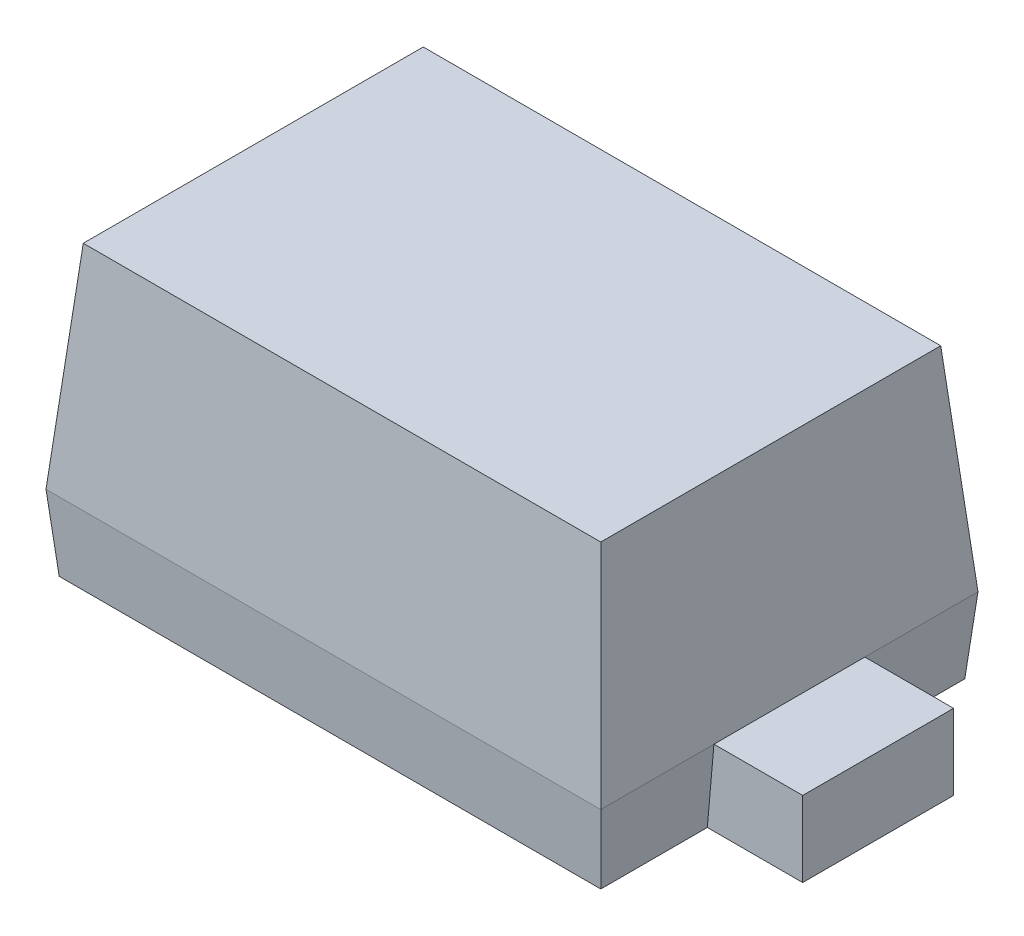
ISO-10303-21;
HEADER;
FILE_DESCRIPTION(('STEP AP214'),'2;1');
FILE_NAME('part.step','',(''),(''),'','','');
FILE_SCHEMA(('AUTOMOTIVE_DESIGN { 1 0 10303 214 1 1 1 1 }'));
ENDSEC;
DATA;
#1=APPLICATION_CONTEXT('core data for automotive mechanical design processes');
#2=APPLICATION_PROTOCOL_DEFINITION('international standard','automotive_design',2000,#1);
#3=PRODUCT_CONTEXT('',#1,'mechanical');
#4=PRODUCT('Part','Part','',(#3));
#5=PRODUCT_RELATED_PRODUCT_CATEGORY('part','',(#4));
#6=PRODUCT_DEFINITION_FORMATION('','',#4);
#7=PRODUCT_DEFINITION_CONTEXT('part definition',#1,'design');
#8=PRODUCT_DEFINITION('design','',#6,#7);
#9=PRODUCT_DEFINITION_SHAPE('','',#8);
#10=(LENGTH_UNIT() NAMED_UNIT(*) SI_UNIT(.MILLI.,.METRE.));
#11=(NAMED_UNIT(*) PLANE_ANGLE_UNIT() SI_UNIT($,.RADIAN.));
#12=(NAMED_UNIT(*) SI_UNIT($,.STERADIAN.) SOLID_ANGLE_UNIT());
#13=UNCERTAINTY_MEASURE_WITH_UNIT(LENGTH_MEASURE(1.E-05),#10,'distance_accuracy_value','');
#14=(GEOMETRIC_REPRESENTATION_CONTEXT(3) GLOBAL_UNCERTAINTY_ASSIGNED_CONTEXT((#13)) GLOBAL_UNIT_ASSIGNED_CONTEXT((#10,
#11,#12)) REPRESENTATION_CONTEXT('',''));
#15=CARTESIAN_POINT('',(0.,0.,0.));
#16=DIRECTION('',(0.,0.,1.));
#17=DIRECTION('',(1.,0.,0.));
#18=AXIS2_PLACEMENT_3D('',#15,#16,#17);
#19=CARTESIAN_POINT('',(-0.625,0.,0.425));
#20=DIRECTION('',(-0.996194698091746,-0.0871557427476584,0.));
#21=DIRECTION('',(0.0871557427476584,-0.996194698091746,0.));
#22=AXIS2_PLACEMENT_3D('',#19,#20,#21);
#23=PLANE('',#22);
#24=DIRECTION('',(0.0871557427476584,-0.996194698091746,0.));
#25=VECTOR('',#24,1.);
#26=CARTESIAN_POINT('',(-0.625,0.,-0.17));
#27=LINE('',#26,#25);
#28=CARTESIAN_POINT('',(-0.625,0.,-0.17));
#29=VERTEX_POINT('',#28);
#30=CARTESIAN_POINT('',(-0.610126927200593,-0.17,-0.17));
#31=VERTEX_POINT('',#30);
#32=EDGE_CURVE('E167',#29,#31,#27,.T.);
#33=ORIENTED_EDGE('',*,*,#32,.F.);
#34=DIRECTION('',(0.,0.,1.));
#35=VECTOR('',#34,1.);
#36=CARTESIAN_POINT('',(-0.625,0.,0.425));
#37=LINE('',#36,#35);
#38=CARTESIAN_POINT('',(-0.625,0.,-0.425));
#39=VERTEX_POINT('',#38);
#40=EDGE_CURVE('E224',#39,#29,#37,.T.);
#41=ORIENTED_EDGE('',*,*,#40,.F.);
#42=DIRECTION('',(-0.0868265938642478,0.992432509138967,-0.0868265938642478));
#43=VECTOR('',#42,1.);
#44=CARTESIAN_POINT('',(-0.625,0.,-0.425));
#45=LINE('',#44,#43);
#46=CARTESIAN_POINT('',(-0.610126927200593,-0.17,-0.410126927200593));
#47=VERTEX_POINT('',#46);
#48=EDGE_CURVE('E235',#47,#39,#45,.T.);
#49=ORIENTED_EDGE('',*,*,#48,.F.);
#50=DIRECTION('',(0.,0.,1.));
#51=VECTOR('',#50,1.);
#52=CARTESIAN_POINT('',(-0.610126927200593,-0.17,0.425));
#53=LINE('',#52,#51);
#54=EDGE_CURVE('E244',#47,#31,#53,.T.);
#55=ORIENTED_EDGE('',*,*,#54,.T.);
#56=EDGE_LOOP('',(#33,#41,#49,#55));
#57=FACE_BOUND('',#56,.T.);
#58=ADVANCED_FACE('F33',(#57),#23,.T.);
#59=CARTESIAN_POINT('',(0.625,0.,0.425));
#60=DIRECTION('',(0.996194698091746,-0.0871557427476584,0.));
#61=DIRECTION('',(0.0871557427476584,0.996194698091746,0.));
#62=AXIS2_PLACEMENT_3D('',#59,#60,#61);
#63=PLANE('',#62);
#64=DIRECTION('',(-0.0871557427476584,-0.996194698091746,0.));
#65=VECTOR('',#64,1.);
#66=CARTESIAN_POINT('',(0.625,0.,0.17));
#67=LINE('',#66,#65);
#68=CARTESIAN_POINT('',(0.625,0.,0.17));
#69=VERTEX_POINT('',#68);
#70=CARTESIAN_POINT('',(0.610126927200593,-0.17,0.17));
#71=VERTEX_POINT('',#70);
#72=EDGE_CURVE('E192',#69,#71,#67,.T.);
#73=ORIENTED_EDGE('',*,*,#72,.F.);
#74=DIRECTION('',(0.,0.,-1.));
#75=VECTOR('',#74,1.);
#76=CARTESIAN_POINT('',(0.625,0.,0.425));
#77=LINE('',#76,#75);
#78=CARTESIAN_POINT('',(0.625,0.,0.425));
#79=VERTEX_POINT('',#78);
#80=EDGE_CURVE('E216',#79,#69,#77,.T.);
#81=ORIENTED_EDGE('',*,*,#80,.F.);
#82=DIRECTION('',(0.0868265938642478,0.992432509138967,0.0868265938642478));
#83=VECTOR('',#82,1.);
#84=CARTESIAN_POINT('',(0.615576428247416,-0.107711918010857,0.415576428247416));
#85=LINE('',#84,#83);
#86=CARTESIAN_POINT('',(0.610126927200593,-0.17,0.410126927200593));
#87=VERTEX_POINT('',#86);
#88=EDGE_CURVE('E11',#87,#79,#85,.T.);
#89=ORIENTED_EDGE('',*,*,#88,.F.);
#90=DIRECTION('',(0.,0.,-1.));
#91=VECTOR('',#90,1.);
#92=CARTESIAN_POINT('',(0.610126927200593,-0.17,0.425));
#93=LINE('',#92,#91);
#94=EDGE_CURVE('E240',#87,#71,#93,.T.);
#95=ORIENTED_EDGE('',*,*,#94,.T.);
#96=EDGE_LOOP('',(#73,#81,#89,#95));
#97=FACE_BOUND('',#96,.T.);
#98=ADVANCED_FACE('F307',(#97),#63,.T.);
#99=DIRECTION('',(0.0871557427476584,0.996194698091746,0.));
#100=VECTOR('',#99,1.);
#101=CARTESIAN_POINT('',(0.625,0.,-0.17));
#102=LINE('',#101,#100);
#103=CARTESIAN_POINT('',(0.610126927200593,-0.17,-0.17));
#104=VERTEX_POINT('',#103);
#105=CARTESIAN_POINT('',(0.625,0.,-0.17));
#106=VERTEX_POINT('',#105);
#107=EDGE_CURVE('E188',#104,#106,#102,.T.);
#108=ORIENTED_EDGE('',*,*,#107,.F.);
#109=CARTESIAN_POINT('',(0.610126927200593,-0.17,-0.410126927200593));
#110=VERTEX_POINT('',#109);
#111=EDGE_CURVE('E230',#104,#110,#93,.T.);
#112=ORIENTED_EDGE('',*,*,#111,.T.);
#113=DIRECTION('',(0.0868265938642478,0.992432509138967,-0.0868265938642478));
#114=VECTOR('',#113,1.);
#115=CARTESIAN_POINT('',(0.618591971208243,-0.0732441042473826,-0.418591971208243));
#116=LINE('',#115,#114);
#117=CARTESIAN_POINT('',(0.625,0.,-0.425));
#118=VERTEX_POINT('',#117);
#119=EDGE_CURVE('E232',#110,#118,#116,.T.);
#120=ORIENTED_EDGE('',*,*,#119,.T.);
#121=EDGE_CURVE('E198',#106,#118,#77,.T.);
#122=ORIENTED_EDGE('',*,*,#121,.F.);
#123=EDGE_LOOP('',(#108,#112,#120,#122));
#124=FACE_BOUND('',#123,.T.);
#125=ADVANCED_FACE('F281',(#124),#63,.T.);
#126=CARTESIAN_POINT('',(-0.625,0.,0.425));
#127=DIRECTION('',(0.,-0.0871557427476584,0.996194698091746));
#128=DIRECTION('',(0.,-0.996194698091746,-0.0871557427476584));
#129=AXIS2_PLACEMENT_3D('',#126,#127,#128);
#130=PLANE('',#129);
#131=DIRECTION('',(1.,0.,0.));
#132=VECTOR('',#131,1.);
#133=CARTESIAN_POINT('',(-0.625,0.,0.425));
#134=LINE('',#133,#132);
#135=CARTESIAN_POINT('',(-0.625,0.,0.425));
#136=VERTEX_POINT('',#135);
#137=EDGE_CURVE('E227',#136,#79,#134,.T.);
#138=ORIENTED_EDGE('',*,*,#137,.F.);
#139=DIRECTION('',(-0.0868265938642478,0.992432509138967,0.0868265938642478));
#140=VECTOR('',#139,1.);
#141=CARTESIAN_POINT('',(-0.625,0.,0.425));
#142=LINE('',#141,#140);
#143=CARTESIAN_POINT('',(-0.610126927200593,-0.17,0.410126927200593));
#144=VERTEX_POINT('',#143);
#145=EDGE_CURVE('E42',#144,#136,#142,.T.);
#146=ORIENTED_EDGE('',*,*,#145,.F.);
#147=DIRECTION('',(1.,0.,0.));
#148=VECTOR('',#147,1.);
#149=CARTESIAN_POINT('',(-0.625,-0.17,0.410126927200593));
#150=LINE('',#149,#148);
#151=EDGE_CURVE('E236',#144,#87,#150,.T.);
#152=ORIENTED_EDGE('',*,*,#151,.T.);
#153=ORIENTED_EDGE('',*,*,#88,.T.);
#154=EDGE_LOOP('',(#138,#146,#152,#153));
#155=FACE_BOUND('',#154,.T.);
#156=ADVANCED_FACE('F35',(#155),#130,.T.);
#157=DIRECTION('',(-0.0871557427476584,0.996194698091746,0.));
#158=VECTOR('',#157,1.);
#159=CARTESIAN_POINT('',(-0.625,0.,0.17));
#160=LINE('',#159,#158);
#161=CARTESIAN_POINT('',(-0.610126927200593,-0.17,0.17));
#162=VERTEX_POINT('',#161);
#163=CARTESIAN_POINT('',(-0.625,0.,0.17));
#164=VERTEX_POINT('',#163);
#165=EDGE_CURVE('E140',#162,#164,#160,.T.);
#166=ORIENTED_EDGE('',*,*,#165,.F.);
#167=EDGE_CURVE('E246',#162,#144,#53,.T.);
#168=ORIENTED_EDGE('',*,*,#167,.T.);
#169=ORIENTED_EDGE('',*,*,#145,.T.);
#170=EDGE_CURVE('E223',#164,#136,#37,.T.);
#171=ORIENTED_EDGE('',*,*,#170,.F.);
#172=EDGE_LOOP('',(#166,#168,#169,#171));
#173=FACE_BOUND('',#172,.T.);
#174=ADVANCED_FACE('F308',(#173),#23,.T.);
#175=CARTESIAN_POINT('',(-0.625,0.,-0.425));
#176=DIRECTION('',(0.,-0.0871557427476584,-0.996194698091746));
#177=DIRECTION('',(0.,0.996194698091746,-0.0871557427476584));
#178=AXIS2_PLACEMENT_3D('',#175,#176,#177);
#179=PLANE('',#178);
#180=DIRECTION('',(-1.,0.,0.));
#181=VECTOR('',#180,1.);
#182=CARTESIAN_POINT('',(-0.625,0.,-0.425));
#183=LINE('',#182,#181);
#184=EDGE_CURVE('E219',#118,#39,#183,.T.);
#185=ORIENTED_EDGE('',*,*,#184,.F.);
#186=ORIENTED_EDGE('',*,*,#119,.F.);
#187=DIRECTION('',(-1.,0.,0.));
#188=VECTOR('',#187,1.);
#189=CARTESIAN_POINT('',(-0.625,-0.17,-0.410126927200593));
#190=LINE('',#189,#188);
#191=EDGE_CURVE('E37',#110,#47,#190,.T.);
#192=ORIENTED_EDGE('',*,*,#191,.T.);
#193=ORIENTED_EDGE('',*,*,#48,.T.);
#194=EDGE_LOOP('',(#185,#186,#192,#193));
#195=FACE_BOUND('',#194,.T.);
#196=ADVANCED_FACE('F258',(#195),#179,.T.);
#197=CARTESIAN_POINT('',(0.,-0.17,0.));
#198=DIRECTION('',(0.,-1.,0.));
#199=DIRECTION('',(0.,0.,-1.));
#200=AXIS2_PLACEMENT_3D('',#197,#198,#199);
#201=PLANE('',#200);
#202=ORIENTED_EDGE('',*,*,#167,.F.);
#203=DIRECTION('',(-1.,0.,0.));
#204=VECTOR('',#203,1.);
#205=CARTESIAN_POINT('',(-0.825,-0.17,0.17));
#206=LINE('',#205,#204);
#207=CARTESIAN_POINT('',(-0.825,-0.17,0.17));
#208=VERTEX_POINT('',#207);
#209=EDGE_CURVE('E160',#162,#208,#206,.T.);
#210=ORIENTED_EDGE('',*,*,#209,.T.);
#211=DIRECTION('',(0.,0.,-1.));
#212=VECTOR('',#211,1.);
#213=CARTESIAN_POINT('',(-0.825,-0.17,-0.17));
#214=LINE('',#213,#212);
#215=CARTESIAN_POINT('',(-0.825,-0.17,-0.17));
#216=VERTEX_POINT('',#215);
#217=EDGE_CURVE('E150',#208,#216,#214,.T.);
#218=ORIENTED_EDGE('',*,*,#217,.T.);
#219=DIRECTION('',(1.,0.,0.));
#220=VECTOR('',#219,1.);
#221=CARTESIAN_POINT('',(-0.625,-0.17,-0.17));
#222=LINE('',#221,#220);
#223=EDGE_CURVE('E143',#216,#31,#222,.T.);
#224=ORIENTED_EDGE('',*,*,#223,.T.);
#225=ORIENTED_EDGE('',*,*,#54,.F.);
#226=ORIENTED_EDGE('',*,*,#191,.F.);
#227=ORIENTED_EDGE('',*,*,#111,.F.);
#228=DIRECTION('',(1.,0.,0.));
#229=VECTOR('',#228,1.);
#230=CARTESIAN_POINT('',(0.625,-0.17,-0.17));
#231=LINE('',#230,#229);
#232=CARTESIAN_POINT('',(0.825,-0.17,-0.17));
#233=VERTEX_POINT('',#232);
#234=EDGE_CURVE('E169',#104,#233,#231,.T.);
#235=ORIENTED_EDGE('',*,*,#234,.T.);
#236=DIRECTION('',(0.,0.,1.));
#237=VECTOR('',#236,1.);
#238=CARTESIAN_POINT('',(0.825,-0.17,-0.17));
#239=LINE('',#238,#237);
#240=CARTESIAN_POINT('',(0.825,-0.17,0.17));
#241=VERTEX_POINT('',#240);
#242=EDGE_CURVE('E180',#233,#241,#239,.T.);
#243=ORIENTED_EDGE('',*,*,#242,.T.);
#244=DIRECTION('',(-1.,0.,0.));
#245=VECTOR('',#244,1.);
#246=CARTESIAN_POINT('',(0.583005441507556,-0.17,0.17));
#247=LINE('',#246,#245);
#248=EDGE_CURVE('E172',#241,#71,#247,.T.);
#249=ORIENTED_EDGE('',*,*,#248,.T.);
#250=ORIENTED_EDGE('',*,*,#94,.F.);
#251=ORIENTED_EDGE('',*,*,#151,.F.);
#252=EDGE_LOOP('',(#202,#210,#218,#224,#225,#226,#227,#235,#243,#249,#250,#251));
#253=FACE_BOUND('',#252,.T.);
#254=ADVANCED_FACE('F262',(#253),#201,.T.);
#255=CARTESIAN_POINT('',(0.625,0.,0.425));
#256=DIRECTION('',(0.996194698091746,0.0871557427476584,0.));
#257=DIRECTION('',(-0.0871557427476584,0.996194698091746,0.));
#258=AXIS2_PLACEMENT_3D('',#255,#256,#257);
#259=PLANE('',#258);
#260=ORIENTED_EDGE('',*,*,#80,.T.);
#261=EDGE_CURVE('E220',#69,#106,#77,.T.);
#262=ORIENTED_EDGE('',*,*,#261,.T.);
#263=ORIENTED_EDGE('',*,*,#121,.T.);
#264=DIRECTION('',(0.0868265938642478,-0.992432509138967,-0.0868265938642478));
#265=VECTOR('',#264,1.);
#266=CARTESIAN_POINT('',(0.615576428247416,0.107711918010857,-0.415576428247416));
#267=LINE('',#266,#265);
#268=CARTESIAN_POINT('',(0.583005441507556,0.48,-0.383005441507556));
#269=VERTEX_POINT('',#268);
#270=EDGE_CURVE('E195',#269,#118,#267,.T.);
#271=ORIENTED_EDGE('',*,*,#270,.F.);
#272=DIRECTION('',(0.,0.,1.));
#273=VECTOR('',#272,1.);
#274=CARTESIAN_POINT('',(0.583005441507557,0.48,0.));
#275=LINE('',#274,#273);
#276=CARTESIAN_POINT('',(0.583005441507556,0.48,0.383005441507556));
#277=VERTEX_POINT('',#276);
#278=EDGE_CURVE('E194',#277,#269,#275,.F.);
#279=ORIENTED_EDGE('',*,*,#278,.F.);
#280=DIRECTION('',(0.0868265938642478,-0.992432509138967,0.0868265938642478));
#281=VECTOR('',#280,1.);
#282=CARTESIAN_POINT('',(0.625,0.,0.425));
#283=LINE('',#282,#281);
#284=EDGE_CURVE('E200',#277,#79,#283,.T.);
#285=ORIENTED_EDGE('',*,*,#284,.T.);
#286=EDGE_LOOP('',(#260,#262,#263,#271,#279,#285));
#287=FACE_BOUND('',#286,.T.);
#288=ADVANCED_FACE('F276',(#287),#259,.T.);
#289=CARTESIAN_POINT('',(-0.625,0.,-0.425));
#290=DIRECTION('',(0.,0.0871557427476584,-0.996194698091746));
#291=DIRECTION('',(0.,0.996194698091746,0.0871557427476584));
#292=AXIS2_PLACEMENT_3D('',#289,#290,#291);
#293=PLANE('',#292);
#294=ORIENTED_EDGE('',*,*,#184,.T.);
#295=DIRECTION('',(-0.0868265938642478,-0.992432509138967,-0.0868265938642478));
#296=VECTOR('',#295,1.);
#297=CARTESIAN_POINT('',(-0.618591971208243,0.0732441042473826,-0.418591971208243));
#298=LINE('',#297,#296);
#299=CARTESIAN_POINT('',(-0.583005441507556,0.48,-0.383005441507556));
#300=VERTEX_POINT('',#299);
#301=EDGE_CURVE('E199',#300,#39,#298,.T.);
#302=ORIENTED_EDGE('',*,*,#301,.F.);
#303=DIRECTION('',(1.,0.,0.));
#304=VECTOR('',#303,1.);
#305=CARTESIAN_POINT('',(0.,0.48,-0.383005441507556));
#306=LINE('',#305,#304);
#307=EDGE_CURVE('E211',#269,#300,#306,.F.);
#308=ORIENTED_EDGE('',*,*,#307,.F.);
#309=ORIENTED_EDGE('',*,*,#270,.T.);
#310=EDGE_LOOP('',(#294,#302,#308,#309));
#311=FACE_BOUND('',#310,.T.);
#312=ADVANCED_FACE('F272',(#311),#293,.T.);
#313=CARTESIAN_POINT('',(-0.625,0.,0.425));
#314=DIRECTION('',(-0.996194698091746,0.0871557427476584,0.));
#315=DIRECTION('',(-0.0871557427476584,-0.996194698091746,0.));
#316=AXIS2_PLACEMENT_3D('',#313,#314,#315);
#317=PLANE('',#316);
#318=ORIENTED_EDGE('',*,*,#40,.T.);
#319=EDGE_CURVE('E228',#29,#164,#37,.T.);
#320=ORIENTED_EDGE('',*,*,#319,.T.);
#321=ORIENTED_EDGE('',*,*,#170,.T.);
#322=DIRECTION('',(-0.0868265938642478,-0.992432509138967,0.0868265938642478));
#323=VECTOR('',#322,1.);
#324=CARTESIAN_POINT('',(-0.625,0.,0.425));
#325=LINE('',#324,#323);
#326=CARTESIAN_POINT('',(-0.583005441507556,0.48,0.383005441507556));
#327=VERTEX_POINT('',#326);
#328=EDGE_CURVE('E203',#327,#136,#325,.T.);
#329=ORIENTED_EDGE('',*,*,#328,.F.);
#330=DIRECTION('',(0.,0.,-1.));
#331=VECTOR('',#330,1.);
#332=CARTESIAN_POINT('',(-0.583005441507557,0.48,0.));
#333=LINE('',#332,#331);
#334=EDGE_CURVE('E213',#300,#327,#333,.F.);
#335=ORIENTED_EDGE('',*,*,#334,.F.);
#336=ORIENTED_EDGE('',*,*,#301,.T.);
#337=EDGE_LOOP('',(#318,#320,#321,#329,#335,#336));
#338=FACE_BOUND('',#337,.T.);
#339=ADVANCED_FACE('F267',(#338),#317,.T.);
#340=CARTESIAN_POINT('',(-0.625,0.,0.425));
#341=DIRECTION('',(0.,0.0871557427476584,0.996194698091746));
#342=DIRECTION('',(0.,-0.996194698091746,0.0871557427476584));
#343=AXIS2_PLACEMENT_3D('',#340,#341,#342);
#344=PLANE('',#343);
#345=ORIENTED_EDGE('',*,*,#137,.T.);
#346=ORIENTED_EDGE('',*,*,#284,.F.);
#347=DIRECTION('',(-1.,0.,0.));
#348=VECTOR('',#347,1.);
#349=CARTESIAN_POINT('',(0.,0.48,0.383005441507556));
#350=LINE('',#349,#348);
#351=EDGE_CURVE('E204',#327,#277,#350,.F.);
#352=ORIENTED_EDGE('',*,*,#351,.F.);
#353=ORIENTED_EDGE('',*,*,#328,.T.);
#354=EDGE_LOOP('',(#345,#346,#352,#353));
#355=FACE_BOUND('',#354,.T.);
#356=ADVANCED_FACE('F302',(#355),#344,.T.);
#357=CARTESIAN_POINT('',(0.,0.48,0.));
#358=DIRECTION('',(0.,-1.,0.));
#359=DIRECTION('',(0.,0.,-1.));
#360=AXIS2_PLACEMENT_3D('',#357,#358,#359);
#361=PLANE('',#360);
#362=ORIENTED_EDGE('',*,*,#278,.T.);
#363=ORIENTED_EDGE('',*,*,#307,.T.);
#364=ORIENTED_EDGE('',*,*,#334,.T.);
#365=ORIENTED_EDGE('',*,*,#351,.T.);
#366=EDGE_LOOP('',(#362,#363,#364,#365));
#367=FACE_BOUND('',#366,.T.);
#368=ADVANCED_FACE('F295',(#367),#361,.F.);
#369=CARTESIAN_POINT('',(0.,0.,0.));
#370=DIRECTION('',(0.,1.,0.));
#371=DIRECTION('',(0.,0.,1.));
#372=AXIS2_PLACEMENT_3D('',#369,#370,#371);
#373=PLANE('',#372);
#374=ORIENTED_EDGE('',*,*,#261,.F.);
#375=DIRECTION('',(-1.,0.,0.));
#376=VECTOR('',#375,1.);
#377=CARTESIAN_POINT('',(0.625,0.,0.17));
#378=LINE('',#377,#376);
#379=CARTESIAN_POINT('',(0.825,0.,0.17));
#380=VERTEX_POINT('',#379);
#381=EDGE_CURVE('E175',#380,#69,#378,.T.);
#382=ORIENTED_EDGE('',*,*,#381,.F.);
#383=DIRECTION('',(0.,0.,1.));
#384=VECTOR('',#383,1.);
#385=CARTESIAN_POINT('',(0.825,0.,-0.17));
#386=LINE('',#385,#384);
#387=CARTESIAN_POINT('',(0.825,0.,-0.17));
#388=VERTEX_POINT('',#387);
#389=EDGE_CURVE('E171',#388,#380,#386,.T.);
#390=ORIENTED_EDGE('',*,*,#389,.F.);
#391=DIRECTION('',(1.,0.,0.));
#392=VECTOR('',#391,1.);
#393=CARTESIAN_POINT('',(0.625,0.,-0.17));
#394=LINE('',#393,#392);
#395=EDGE_CURVE('E58',#106,#388,#394,.T.);
#396=ORIENTED_EDGE('',*,*,#395,.F.);
#397=EDGE_LOOP('',(#374,#382,#390,#396));
#398=FACE_BOUND('',#397,.T.);
#399=ADVANCED_FACE('F293',(#398),#373,.T.);
#400=CARTESIAN_POINT('',(0.583005441507556,0.,0.17));
#401=DIRECTION('',(0.,0.,1.));
#402=DIRECTION('',(1.,0.,0.));
#403=AXIS2_PLACEMENT_3D('',#400,#401,#402);
#404=PLANE('',#403);
#405=ORIENTED_EDGE('',*,*,#381,.T.);
#406=ORIENTED_EDGE('',*,*,#72,.T.);
#407=ORIENTED_EDGE('',*,*,#248,.F.);
#408=DIRECTION('',(0.,-1.,0.));
#409=VECTOR('',#408,1.);
#410=CARTESIAN_POINT('',(0.825,0.,0.17));
#411=LINE('',#410,#409);
#412=EDGE_CURVE('E185',#380,#241,#411,.T.);
#413=ORIENTED_EDGE('',*,*,#412,.F.);
#414=EDGE_LOOP('',(#405,#406,#407,#413));
#415=FACE_BOUND('',#414,.T.);
#416=ADVANCED_FACE('F291',(#415),#404,.T.);
#417=CARTESIAN_POINT('',(0.825,0.,-0.17));
#418=DIRECTION('',(1.,0.,0.));
#419=DIRECTION('',(0.,0.,-1.));
#420=AXIS2_PLACEMENT_3D('',#417,#418,#419);
#421=PLANE('',#420);
#422=ORIENTED_EDGE('',*,*,#242,.F.);
#423=DIRECTION('',(0.,-1.,0.));
#424=VECTOR('',#423,1.);
#425=CARTESIAN_POINT('',(0.825,0.,-0.17));
#426=LINE('',#425,#424);
#427=EDGE_CURVE('E178',#388,#233,#426,.T.);
#428=ORIENTED_EDGE('',*,*,#427,.F.);
#429=ORIENTED_EDGE('',*,*,#389,.T.);
#430=ORIENTED_EDGE('',*,*,#412,.T.);
#431=EDGE_LOOP('',(#422,#428,#429,#430));
#432=FACE_BOUND('',#431,.T.);
#433=ADVANCED_FACE('F288',(#432),#421,.T.);
#434=CARTESIAN_POINT('',(0.625,0.,-0.17));
#435=DIRECTION('',(0.,0.,-1.));
#436=DIRECTION('',(-1.,0.,0.));
#437=AXIS2_PLACEMENT_3D('',#434,#435,#436);
#438=PLANE('',#437);
#439=ORIENTED_EDGE('',*,*,#234,.F.);
#440=ORIENTED_EDGE('',*,*,#107,.T.);
#441=ORIENTED_EDGE('',*,*,#395,.T.);
#442=ORIENTED_EDGE('',*,*,#427,.T.);
#443=EDGE_LOOP('',(#439,#440,#441,#442));
#444=FACE_BOUND('',#443,.T.);
#445=ADVANCED_FACE('F283',(#444),#438,.T.);
#446=CARTESIAN_POINT('',(0.,0.,0.));
#447=DIRECTION('',(0.,1.,0.));
#448=DIRECTION('',(0.,0.,1.));
#449=AXIS2_PLACEMENT_3D('',#446,#447,#448);
#450=PLANE('',#449);
#451=ORIENTED_EDGE('',*,*,#319,.F.);
#452=DIRECTION('',(1.,0.,0.));
#453=VECTOR('',#452,1.);
#454=CARTESIAN_POINT('',(-0.825,0.,-0.17));
#455=LINE('',#454,#453);
#456=CARTESIAN_POINT('',(-0.825,0.,-0.17));
#457=VERTEX_POINT('',#456);
#458=EDGE_CURVE('E152',#457,#29,#455,.T.);
#459=ORIENTED_EDGE('',*,*,#458,.F.);
#460=DIRECTION('',(0.,0.,-1.));
#461=VECTOR('',#460,1.);
#462=CARTESIAN_POINT('',(-0.825,0.,-0.17));
#463=LINE('',#462,#461);
#464=CARTESIAN_POINT('',(-0.825,0.,0.17));
#465=VERTEX_POINT('',#464);
#466=EDGE_CURVE('E142',#465,#457,#463,.T.);
#467=ORIENTED_EDGE('',*,*,#466,.F.);
#468=DIRECTION('',(-1.,0.,0.));
#469=VECTOR('',#468,1.);
#470=CARTESIAN_POINT('',(-0.583005441507556,0.,0.17));
#471=LINE('',#470,#469);
#472=EDGE_CURVE('E50',#164,#465,#471,.T.);
#473=ORIENTED_EDGE('',*,*,#472,.F.);
#474=EDGE_LOOP('',(#451,#459,#467,#473));
#475=FACE_BOUND('',#474,.T.);
#476=ADVANCED_FACE('F155',(#475),#450,.T.);
#477=CARTESIAN_POINT('',(-0.625,0.,-0.17));
#478=DIRECTION('',(0.,0.,-1.));
#479=DIRECTION('',(-1.,0.,0.));
#480=AXIS2_PLACEMENT_3D('',#477,#478,#479);
#481=PLANE('',#480);
#482=ORIENTED_EDGE('',*,*,#458,.T.);
#483=ORIENTED_EDGE('',*,*,#32,.T.);
#484=ORIENTED_EDGE('',*,*,#223,.F.);
#485=DIRECTION('',(0.,-1.,0.));
#486=VECTOR('',#485,1.);
#487=CARTESIAN_POINT('',(-0.825,0.,-0.17));
#488=LINE('',#487,#486);
#489=EDGE_CURVE('E151',#457,#216,#488,.T.);
#490=ORIENTED_EDGE('',*,*,#489,.F.);
#491=EDGE_LOOP('',(#482,#483,#484,#490));
#492=FACE_BOUND('',#491,.T.);
#493=ADVANCED_FACE('F264',(#492),#481,.T.);
#494=CARTESIAN_POINT('',(-0.825,0.,-0.17));
#495=DIRECTION('',(-1.,0.,0.));
#496=DIRECTION('',(0.,0.,1.));
#497=AXIS2_PLACEMENT_3D('',#494,#495,#496);
#498=PLANE('',#497);
#499=ORIENTED_EDGE('',*,*,#217,.F.);
#500=DIRECTION('',(0.,-1.,0.));
#501=VECTOR('',#500,1.);
#502=CARTESIAN_POINT('',(-0.825,0.,0.17));
#503=LINE('',#502,#501);
#504=EDGE_CURVE('E137',#465,#208,#503,.T.);
#505=ORIENTED_EDGE('',*,*,#504,.F.);
#506=ORIENTED_EDGE('',*,*,#466,.T.);
#507=ORIENTED_EDGE('',*,*,#489,.T.);
#508=EDGE_LOOP('',(#499,#505,#506,#507));
#509=FACE_BOUND('',#508,.T.);
#510=ADVANCED_FACE('F147',(#509),#498,.T.);
#511=CARTESIAN_POINT('',(-0.825,0.,0.17));
#512=DIRECTION('',(0.,0.,1.));
#513=DIRECTION('',(1.,0.,0.));
#514=AXIS2_PLACEMENT_3D('',#511,#512,#513);
#515=PLANE('',#514);
#516=ORIENTED_EDGE('',*,*,#209,.F.);
#517=ORIENTED_EDGE('',*,*,#165,.T.);
#518=ORIENTED_EDGE('',*,*,#472,.T.);
#519=ORIENTED_EDGE('',*,*,#504,.T.);
#520=EDGE_LOOP('',(#516,#517,#518,#519));
#521=FACE_BOUND('',#520,.T.);
#522=ADVANCED_FACE('F136',(#521),#515,.T.);
#523=CLOSED_SHELL('',(#58,#98,#125,#156,#174,#196,#254,#288,#312,#339,#356,#368,#399,#416,#433,
#445,#476,#493,#510,#522));
#524=MANIFOLD_SOLID_BREP('B2',#523);
#525=ADVANCED_BREP_SHAPE_REPRESENTATION('',(#18,#524),#14);
#526=SHAPE_DEFINITION_REPRESENTATION(#9,#525);
ENDSEC;
END-ISO-10303-21;
